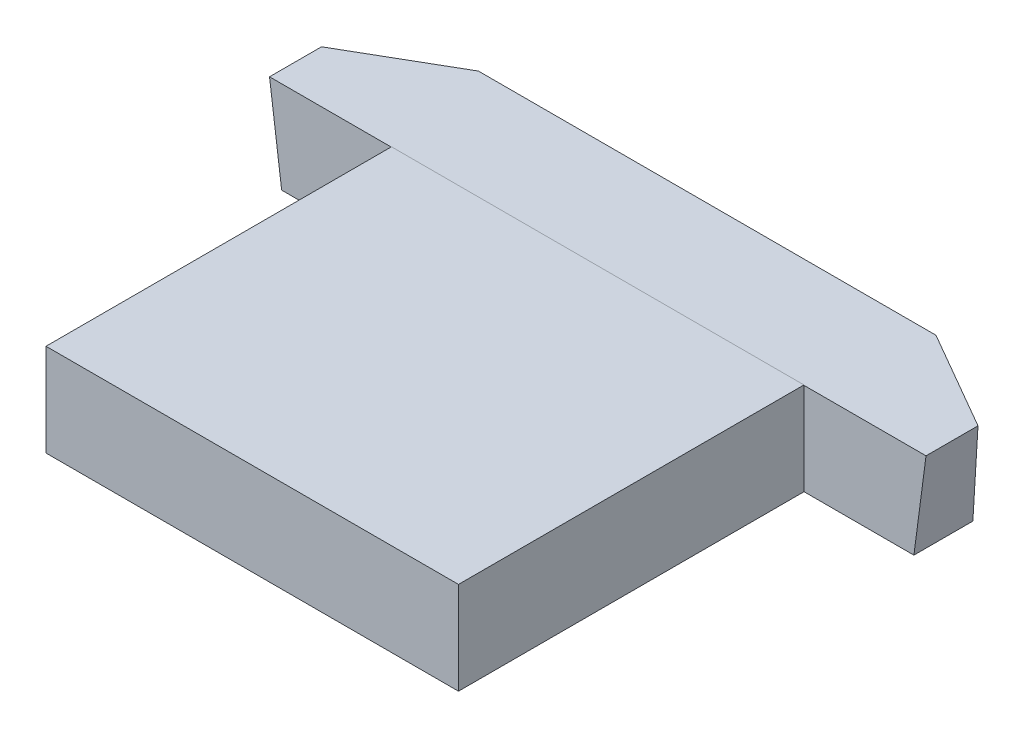
ISO-10303-21;
HEADER;
FILE_DESCRIPTION(('STEP AP214'),'2;1');
FILE_NAME('part.step','',(''),(''),'','','');
FILE_SCHEMA(('AUTOMOTIVE_DESIGN { 1 0 10303 214 1 1 1 1 }'));
ENDSEC;
DATA;
#1=APPLICATION_CONTEXT('core data for automotive mechanical design processes');
#2=APPLICATION_PROTOCOL_DEFINITION('international standard','automotive_design',2000,#1);
#3=PRODUCT_CONTEXT('',#1,'mechanical');
#4=PRODUCT('Part','Part','',(#3));
#5=PRODUCT_RELATED_PRODUCT_CATEGORY('part','',(#4));
#6=PRODUCT_DEFINITION_FORMATION('','',#4);
#7=PRODUCT_DEFINITION_CONTEXT('part definition',#1,'design');
#8=PRODUCT_DEFINITION('design','',#6,#7);
#9=PRODUCT_DEFINITION_SHAPE('','',#8);
#10=(LENGTH_UNIT() NAMED_UNIT(*) SI_UNIT(.MILLI.,.METRE.));
#11=(NAMED_UNIT(*) PLANE_ANGLE_UNIT() SI_UNIT($,.RADIAN.));
#12=(NAMED_UNIT(*) SI_UNIT($,.STERADIAN.) SOLID_ANGLE_UNIT());
#13=UNCERTAINTY_MEASURE_WITH_UNIT(LENGTH_MEASURE(1.E-05),#10,'distance_accuracy_value','');
#14=(GEOMETRIC_REPRESENTATION_CONTEXT(3) GLOBAL_UNCERTAINTY_ASSIGNED_CONTEXT((#13)) GLOBAL_UNIT_ASSIGNED_CONTEXT((#10,
#11,#12)) REPRESENTATION_CONTEXT('',''));
#15=CARTESIAN_POINT('',(0.,0.,0.));
#16=DIRECTION('',(0.,0.,1.));
#17=DIRECTION('',(1.,0.,0.));
#18=AXIS2_PLACEMENT_3D('',#15,#16,#17);
#19=CARTESIAN_POINT('',(3.10999999999989,-2.3789,0.57249999999999));
#20=DIRECTION('',(0.999999999999986,0.,0.));
#21=DIRECTION('',(0.,0.,-0.999999999999986));
#22=AXIS2_PLACEMENT_3D('',#19,#20,#21);
#23=PLANE('',#22);
#24=DIRECTION('',(0.,0.99144486137382,0.130526192219973));
#25=VECTOR('',#24,1.);
#26=CARTESIAN_POINT('',(3.10999999999978,-0.840485049759566,-4.618151955986));
#27=LINE('',#26,#25);
#28=CARTESIAN_POINT('',(3.10999999999967,-0.989999999999561,-4.637835972612));
#29=VERTEX_POINT('',#28);
#30=CARTESIAN_POINT('',(3.10999999999978,-0.983899999999566,-4.63703289237601));
#31=VERTEX_POINT('',#30);
#32=EDGE_CURVE('E11',#29,#31,#27,.T.);
#33=ORIENTED_EDGE('',*,*,#32,.T.);
#34=DIRECTION('',(0.,0.,-0.999999999999986));
#35=VECTOR('',#34,1.);
#36=CARTESIAN_POINT('',(3.10999999999989,-0.983899999999566,-6.2875));
#37=LINE('',#36,#35);
#38=CARTESIAN_POINT('',(3.10999999999989,-0.983900000000003,0.57249999999999));
#39=VERTEX_POINT('',#38);
#40=EDGE_CURVE('E41',#39,#31,#37,.T.);
#41=ORIENTED_EDGE('',*,*,#40,.F.);
#42=DIRECTION('',(0.,1.,0.));
#43=VECTOR('',#42,1.);
#44=CARTESIAN_POINT('',(3.10999999999989,-2.3789,0.57249999999999));
#45=LINE('',#44,#43);
#46=CARTESIAN_POINT('',(3.10999999999989,-2.3789,0.57249999999999));
#47=VERTEX_POINT('',#46);
#48=EDGE_CURVE('E237',#47,#39,#45,.T.);
#49=ORIENTED_EDGE('',*,*,#48,.F.);
#50=DIRECTION('',(0.,0.,-0.999999999999986));
#51=VECTOR('',#50,1.);
#52=CARTESIAN_POINT('',(3.10999999999978,-2.3789,0.408880478543996));
#53=LINE('',#52,#51);
#54=CARTESIAN_POINT('',(3.10999999999967,-2.37889999999957,-4.637835972612));
#55=VERTEX_POINT('',#54);
#56=EDGE_CURVE('E27',#47,#55,#53,.T.);
#57=ORIENTED_EDGE('',*,*,#56,.T.);
#58=DIRECTION('',(0.,1.,0.));
#59=VECTOR('',#58,1.);
#60=CARTESIAN_POINT('',(3.10999999999967,-2.37889999999957,-4.637835972612));
#61=LINE('',#60,#59);
#62=EDGE_CURVE('E173',#55,#29,#61,.T.);
#63=ORIENTED_EDGE('',*,*,#62,.T.);
#64=EDGE_LOOP('',(#33,#41,#49,#57,#63));
#65=FACE_BOUND('',#64,.T.);
#66=ADVANCED_FACE('F16',(#65),#23,.T.);
#67=CARTESIAN_POINT('',(1.77916675358278,-0.983899999999566,-6.56286337769486));
#68=DIRECTION('',(0.,1.,0.));
#69=DIRECTION('',(0.999999999999986,0.,0.));
#70=AXIS2_PLACEMENT_3D('',#67,#68,#69);
#71=PLANE('',#70);
#72=DIRECTION('',(-0.999999999999986,0.,0.));
#73=VECTOR('',#72,1.);
#74=CARTESIAN_POINT('',(-1.650416623208,-0.983899999999566,-4.63703289237687));
#75=LINE('',#74,#73);
#76=CARTESIAN_POINT('',(-3.11,-0.983899999999566,-4.63703289237513));
#77=VERTEX_POINT('',#76);
#78=EDGE_CURVE('E170',#31,#77,#75,.T.);
#79=ORIENTED_EDGE('',*,*,#78,.T.);
#80=DIRECTION('',(0.,0.,0.999999999999986));
#81=VECTOR('',#80,1.);
#82=CARTESIAN_POINT('',(-3.10999999999956,-0.983900000000003,0.572499999999129));
#83=LINE('',#82,#81);
#84=CARTESIAN_POINT('',(-3.10999999999956,-0.983900000000003,0.572499999999129));
#85=VERTEX_POINT('',#84);
#86=EDGE_CURVE('E174',#77,#85,#83,.T.);
#87=ORIENTED_EDGE('',*,*,#86,.T.);
#88=DIRECTION('',(0.999999999999986,0.,0.));
#89=VECTOR('',#88,1.);
#90=CARTESIAN_POINT('',(3.10999999999989,-0.983900000000003,0.57249999999999));
#91=LINE('',#90,#89);
#92=EDGE_CURVE('E88',#85,#39,#91,.T.);
#93=ORIENTED_EDGE('',*,*,#92,.T.);
#94=ORIENTED_EDGE('',*,*,#40,.T.);
#95=EDGE_LOOP('',(#79,#87,#93,#94));
#96=FACE_BOUND('',#95,.T.);
#97=ADVANCED_FACE('F193',(#96),#71,.T.);
#98=CARTESIAN_POINT('',(-3.11,-2.37889999999957,-6.2875));
#99=DIRECTION('',(-0.999999999999986,0.,0.));
#100=DIRECTION('',(0.,1.,0.));
#101=AXIS2_PLACEMENT_3D('',#98,#99,#100);
#102=PLANE('',#101);
#103=DIRECTION('',(0.,-0.99144486137382,-0.130526192219973));
#104=VECTOR('',#103,1.);
#105=CARTESIAN_POINT('',(-3.10999999999999,-1.28435971210956,-4.67658916389913));
#106=LINE('',#105,#104);
#107=CARTESIAN_POINT('',(-3.11,-0.989999999999561,-4.63783597261114));
#108=VERTEX_POINT('',#107);
#109=EDGE_CURVE('E214',#77,#108,#106,.T.);
#110=ORIENTED_EDGE('',*,*,#109,.T.);
#111=DIRECTION('',(0.,-1.,0.));
#112=VECTOR('',#111,1.);
#113=CARTESIAN_POINT('',(-3.11,-2.37889999999957,-4.63783597261114));
#114=LINE('',#113,#112);
#115=CARTESIAN_POINT('',(-3.11,-2.37889999999957,-4.63783597261114));
#116=VERTEX_POINT('',#115);
#117=EDGE_CURVE('E184',#108,#116,#114,.T.);
#118=ORIENTED_EDGE('',*,*,#117,.T.);
#119=DIRECTION('',(0.,0.,0.999999999999986));
#120=VECTOR('',#119,1.);
#121=CARTESIAN_POINT('',(-3.11,-2.3789,-3.02111952145513));
#122=LINE('',#121,#120);
#123=CARTESIAN_POINT('',(-3.10999999999956,-2.3789,0.572499999999129));
#124=VERTEX_POINT('',#123);
#125=EDGE_CURVE('E180',#116,#124,#122,.T.);
#126=ORIENTED_EDGE('',*,*,#125,.T.);
#127=DIRECTION('',(0.,1.,0.));
#128=VECTOR('',#127,1.);
#129=CARTESIAN_POINT('',(-3.10999999999956,-2.3789,0.572499999999129));
#130=LINE('',#129,#128);
#131=EDGE_CURVE('E185',#124,#85,#130,.T.);
#132=ORIENTED_EDGE('',*,*,#131,.T.);
#133=ORIENTED_EDGE('',*,*,#86,.F.);
#134=EDGE_LOOP('',(#110,#118,#126,#132,#133));
#135=FACE_BOUND('',#134,.T.);
#136=ADVANCED_FACE('F198',(#135),#102,.T.);
#137=CARTESIAN_POINT('',(-4.94966402738778,-2.37889999999957,-4.637835972612));
#138=DIRECTION('',(0.,0.,0.999999999999986));
#139=DIRECTION('',(0.999999999999986,0.,0.));
#140=AXIS2_PLACEMENT_3D('',#137,#138,#139);
#141=PLANE('',#140);
#142=DIRECTION('',(-0.999999999999986,0.,0.));
#143=VECTOR('',#142,1.);
#144=CARTESIAN_POINT('',(7.83792434831367,-0.989999999999561,-4.637835972612));
#145=LINE('',#144,#143);
#146=CARTESIAN_POINT('',(-4.94966402738778,-0.989999999999561,-4.63783597261286));
#147=VERTEX_POINT('',#146);
#148=EDGE_CURVE('E102',#108,#147,#145,.T.);
#149=ORIENTED_EDGE('',*,*,#148,.T.);
#150=DIRECTION('',(0.130526192219973,-0.99144486137382,0.));
#151=VECTOR('',#150,1.);
#152=CARTESIAN_POINT('',(-4.92496357075878,-1.17761859503256,-4.637835972612));
#153=LINE('',#152,#151);
#154=CARTESIAN_POINT('',(-4.76681187348921,-2.37889999999957,-4.637835972612));
#155=VERTEX_POINT('',#154);
#156=EDGE_CURVE('E207',#147,#155,#153,.T.);
#157=ORIENTED_EDGE('',*,*,#156,.T.);
#158=DIRECTION('',(0.999999999999986,0.,0.));
#159=VECTOR('',#158,1.);
#160=CARTESIAN_POINT('',(-2.00066084279178,-2.37889999999957,-4.63783597261114));
#161=LINE('',#160,#159);
#162=EDGE_CURVE('E148',#155,#116,#161,.T.);
#163=ORIENTED_EDGE('',*,*,#162,.T.);
#164=ORIENTED_EDGE('',*,*,#117,.F.);
#165=EDGE_LOOP('',(#149,#157,#163,#164));
#166=FACE_BOUND('',#165,.T.);
#167=ADVANCED_FACE('F362',(#166),#141,.T.);
#168=CARTESIAN_POINT('',(-4.94966402738778,-2.37889999999957,-4.637835972612));
#169=DIRECTION('',(0.,0.,0.999999999999986));
#170=DIRECTION('',(0.999999999999986,0.,0.));
#171=AXIS2_PLACEMENT_3D('',#168,#169,#170);
#172=PLANE('',#171);
#173=DIRECTION('',(-0.999999999999986,0.,0.));
#174=VECTOR('',#173,1.);
#175=CARTESIAN_POINT('',(7.83792434831367,-0.989999999999561,-4.637835972612));
#176=LINE('',#175,#174);
#177=CARTESIAN_POINT('',(4.94966402738778,-0.989999999999561,-4.637835972612));
#178=VERTEX_POINT('',#177);
#179=EDGE_CURVE('E222',#178,#29,#176,.T.);
#180=ORIENTED_EDGE('',*,*,#179,.T.);
#181=ORIENTED_EDGE('',*,*,#62,.F.);
#182=DIRECTION('',(0.999999999999986,0.,0.));
#183=VECTOR('',#182,1.);
#184=CARTESIAN_POINT('',(-2.00066084279178,-2.37889999999957,-4.63783597261114));
#185=LINE('',#184,#183);
#186=CARTESIAN_POINT('',(4.76681187348889,-2.37889999999957,-4.63783597261201));
#187=VERTEX_POINT('',#186);
#188=EDGE_CURVE('E226',#55,#187,#185,.T.);
#189=ORIENTED_EDGE('',*,*,#188,.T.);
#190=DIRECTION('',(0.130526192219973,0.99144486137382,0.));
#191=VECTOR('',#190,1.);
#192=CARTESIAN_POINT('',(4.84063571481867,-1.81815225360656,-4.637835972612));
#193=LINE('',#192,#191);
#194=EDGE_CURVE('E232',#187,#178,#193,.T.);
#195=ORIENTED_EDGE('',*,*,#194,.T.);
#196=EDGE_LOOP('',(#180,#181,#189,#195));
#197=FACE_BOUND('',#196,.T.);
#198=ADVANCED_FACE('F280',(#197),#172,.T.);
#199=CARTESIAN_POINT('',(-3.10999999999956,-2.3789,0.572499999999129));
#200=DIRECTION('',(0.,0.,0.999999999999986));
#201=DIRECTION('',(0.999999999999986,0.,0.));
#202=AXIS2_PLACEMENT_3D('',#199,#200,#201);
#203=PLANE('',#202);
#204=DIRECTION('',(0.999999999999986,0.,0.));
#205=VECTOR('',#204,1.);
#206=CARTESIAN_POINT('',(-1.080828829097,-2.3789,0.572500000000004));
#207=LINE('',#206,#205);
#208=EDGE_CURVE('E254',#124,#47,#207,.T.);
#209=ORIENTED_EDGE('',*,*,#208,.T.);
#210=ORIENTED_EDGE('',*,*,#48,.T.);
#211=ORIENTED_EDGE('',*,*,#92,.F.);
#212=ORIENTED_EDGE('',*,*,#131,.F.);
#213=EDGE_LOOP('',(#209,#210,#211,#212));
#214=FACE_BOUND('',#213,.T.);
#215=ADVANCED_FACE('F379',(#214),#203,.T.);
#216=CARTESIAN_POINT('',(5.07999999999978,4.37150315946155E-13,-4.5075));
#217=DIRECTION('',(0.991444861373806,-0.130526192219976,0.));
#218=DIRECTION('',(0.,0.,-0.999999999999986));
#219=AXIS2_PLACEMENT_3D('',#216,#217,#218);
#220=PLANE('',#219);
#221=ORIENTED_EDGE('',*,*,#194,.F.);
#222=DIRECTION('',(0.,0.,-0.999999999999986));
#223=VECTOR('',#222,1.);
#224=CARTESIAN_POINT('',(4.76681187348878,-2.3789,-2.13111952145599));
#225=LINE('',#224,#223);
#226=CARTESIAN_POINT('',(4.76681187348878,-2.37889999999957,-5.52704433649101));
#227=VERTEX_POINT('',#226);
#228=EDGE_CURVE('E233',#187,#227,#225,.T.);
#229=ORIENTED_EDGE('',*,*,#228,.T.);
#230=DIRECTION('',(0.130157132392033,0.988641573667275,0.0751462554235118));
#231=VECTOR('',#230,1.);
#232=CARTESIAN_POINT('',(4.77002848932789,-2.35446737701156,-5.525187222471));
#233=LINE('',#232,#231);
#234=CARTESIAN_POINT('',(4.94966402738789,-0.989999999999561,-5.42147459621599));
#235=VERTEX_POINT('',#234);
#236=EDGE_CURVE('E238',#227,#235,#233,.T.);
#237=ORIENTED_EDGE('',*,*,#236,.T.);
#238=DIRECTION('',(0.,0.,0.999999999999986));
#239=VECTOR('',#238,1.);
#240=CARTESIAN_POINT('',(4.94966402738778,-0.989999999999561,-4.637835972612));
#241=LINE('',#240,#239);
#242=EDGE_CURVE('E168',#235,#178,#241,.T.);
#243=ORIENTED_EDGE('',*,*,#242,.T.);
#244=EDGE_LOOP('',(#221,#229,#237,#243));
#245=FACE_BOUND('',#244,.T.);
#246=ADVANCED_FACE('F285',(#245),#220,.T.);
#247=CARTESIAN_POINT('',(0.948342341804784,-2.3789,0.245260957088864));
#248=DIRECTION('',(0.,1.,0.));
#249=DIRECTION('',(0.999999999999986,0.,0.));
#250=AXIS2_PLACEMENT_3D('',#247,#248,#249);
#251=PLANE('',#250);
#252=ORIENTED_EDGE('',*,*,#188,.F.);
#253=ORIENTED_EDGE('',*,*,#56,.F.);
#254=ORIENTED_EDGE('',*,*,#208,.F.);
#255=ORIENTED_EDGE('',*,*,#125,.F.);
#256=ORIENTED_EDGE('',*,*,#162,.F.);
#257=DIRECTION('',(0.,0.,0.999999999999986));
#258=VECTOR('',#257,1.);
#259=CARTESIAN_POINT('',(-4.766811873489,-2.3789,-2.13111952145513));
#260=LINE('',#259,#258);
#261=CARTESIAN_POINT('',(-4.76681187348878,-2.37889999999957,-5.52704433649187));
#262=VERTEX_POINT('',#261);
#263=EDGE_CURVE('E144',#262,#155,#260,.T.);
#264=ORIENTED_EDGE('',*,*,#263,.F.);
#265=DIRECTION('',(-0.866025403784315,0.,0.500000000000169));
#266=VECTOR('',#265,1.);
#267=CARTESIAN_POINT('',(-3.964795875363,-2.37889999999957,-5.99008848890399));
#268=LINE('',#267,#266);
#269=CARTESIAN_POINT('',(-3.449664027388,-2.37889999999957,-6.28750000000086));
#270=VERTEX_POINT('',#269);
#271=EDGE_CURVE('E20',#270,#262,#268,.T.);
#272=ORIENTED_EDGE('',*,*,#271,.F.);
#273=DIRECTION('',(-0.999999999999986,0.,0.));
#274=VECTOR('',#273,1.);
#275=CARTESIAN_POINT('',(4.39313334505978,-2.37889999999957,-6.2875));
#276=LINE('',#275,#274);
#277=CARTESIAN_POINT('',(3.44966402738778,-2.37889999999957,-6.2875));
#278=VERTEX_POINT('',#277);
#279=EDGE_CURVE('E221',#278,#270,#276,.T.);
#280=ORIENTED_EDGE('',*,*,#279,.F.);
#281=DIRECTION('',(-0.866025403784315,0.,-0.500000000000176));
#282=VECTOR('',#281,1.);
#283=CARTESIAN_POINT('',(4.676052631717,-2.37889999999957,-5.57944420916));
#284=LINE('',#283,#282);
#285=EDGE_CURVE('E188',#227,#278,#284,.T.);
#286=ORIENTED_EDGE('',*,*,#285,.F.);
#287=ORIENTED_EDGE('',*,*,#228,.F.);
#288=EDGE_LOOP('',(#252,#253,#254,#255,#256,#264,#272,#280,#286,#287));
#289=FACE_BOUND('',#288,.T.);
#290=ADVANCED_FACE('F146',(#289),#251,.F.);
#291=CARTESIAN_POINT('',(4.94966402738789,-2.38599999999956,-5.42147459621599));
#292=DIRECTION('',(-0.500000000000176,0.,0.866025403784315));
#293=DIRECTION('',(0.,1.,0.));
#294=AXIS2_PLACEMENT_3D('',#291,#292,#293);
#295=PLANE('',#294);
#296=ORIENTED_EDGE('',*,*,#285,.T.);
#297=DIRECTION('',(0.,1.,0.));
#298=VECTOR('',#297,1.);
#299=CARTESIAN_POINT('',(3.44966402738778,-2.38599999999956,-6.2875));
#300=LINE('',#299,#298);
#301=CARTESIAN_POINT('',(3.44966402738778,-0.989999999999561,-6.2875));
#302=VERTEX_POINT('',#301);
#303=EDGE_CURVE('E164',#278,#302,#300,.T.);
#304=ORIENTED_EDGE('',*,*,#303,.T.);
#305=DIRECTION('',(0.866025403784315,0.,0.500000000000176));
#306=VECTOR('',#305,1.);
#307=CARTESIAN_POINT('',(4.94966402738789,-0.989999999999561,-5.42147459621599));
#308=LINE('',#307,#306);
#309=EDGE_CURVE('E157',#302,#235,#308,.T.);
#310=ORIENTED_EDGE('',*,*,#309,.T.);
#311=ORIENTED_EDGE('',*,*,#236,.F.);
#312=EDGE_LOOP('',(#296,#304,#310,#311));
#313=FACE_BOUND('',#312,.T.);
#314=ADVANCED_FACE('F18',(#313),#295,.F.);
#315=CARTESIAN_POINT('',(-5.07999999999978,4.37150315946155E-13,-4.5075));
#316=DIRECTION('',(-0.991444861373806,-0.130526192219976,0.));
#317=DIRECTION('',(-0.130526192219973,0.99144486137382,0.));
#318=AXIS2_PLACEMENT_3D('',#315,#316,#317);
#319=PLANE('',#318);
#320=ORIENTED_EDGE('',*,*,#156,.F.);
#321=DIRECTION('',(0.,0.,0.999999999999986));
#322=VECTOR('',#321,1.);
#323=CARTESIAN_POINT('',(-4.94966402738778,-0.989999999999561,-4.63783597261286));
#324=LINE('',#323,#322);
#325=CARTESIAN_POINT('',(-4.94966402738778,-0.989999999999561,-5.42147459621599));
#326=VERTEX_POINT('',#325);
#327=EDGE_CURVE('E141',#326,#147,#324,.T.);
#328=ORIENTED_EDGE('',*,*,#327,.F.);
#329=DIRECTION('',(0.130157132392033,-0.988641573667275,-0.0751462554235118));
#330=VECTOR('',#329,1.);
#331=CARTESIAN_POINT('',(-4.770028489328,-2.35446737701157,-5.52518722247013));
#332=LINE('',#331,#330);
#333=EDGE_CURVE('E134',#326,#262,#332,.T.);
#334=ORIENTED_EDGE('',*,*,#333,.T.);
#335=ORIENTED_EDGE('',*,*,#263,.T.);
#336=EDGE_LOOP('',(#320,#328,#334,#335));
#337=FACE_BOUND('',#336,.T.);
#338=ADVANCED_FACE('F155',(#337),#319,.T.);
#339=CARTESIAN_POINT('',(-5.07999999999978,4.37150315946155E-13,-4.5075));
#340=DIRECTION('',(0.,0.130526192219976,-0.991444861373806));
#341=DIRECTION('',(-0.999999999999986,0.,0.));
#342=AXIS2_PLACEMENT_3D('',#339,#340,#341);
#343=PLANE('',#342);
#344=ORIENTED_EDGE('',*,*,#32,.F.);
#345=DIRECTION('',(-0.999999999999986,0.,0.));
#346=VECTOR('',#345,1.);
#347=CARTESIAN_POINT('',(7.83792434831367,-0.989999999999561,-4.637835972612));
#348=LINE('',#347,#346);
#349=EDGE_CURVE('E152',#29,#108,#348,.T.);
#350=ORIENTED_EDGE('',*,*,#349,.T.);
#351=ORIENTED_EDGE('',*,*,#109,.F.);
#352=ORIENTED_EDGE('',*,*,#78,.F.);
#353=EDGE_LOOP('',(#344,#350,#351,#352));
#354=FACE_BOUND('',#353,.T.);
#355=ADVANCED_FACE('F391',(#354),#343,.T.);
#356=CARTESIAN_POINT('',(7.83792434831378,-2.38499999999956,-6.28750000000086));
#357=DIRECTION('',(0.,0.,0.999999999999986));
#358=DIRECTION('',(0.999999999999986,0.,0.));
#359=AXIS2_PLACEMENT_3D('',#356,#357,#358);
#360=PLANE('',#359);
#361=ORIENTED_EDGE('',*,*,#279,.T.);
#362=DIRECTION('',(0.,1.,0.));
#363=VECTOR('',#362,1.);
#364=CARTESIAN_POINT('',(-3.449664027388,-2.38599999999956,-6.28750000000086));
#365=LINE('',#364,#363);
#366=CARTESIAN_POINT('',(-3.449664027388,-0.989999999999561,-6.28750000000088));
#367=VERTEX_POINT('',#366);
#368=EDGE_CURVE('E137',#270,#367,#365,.T.);
#369=ORIENTED_EDGE('',*,*,#368,.T.);
#370=DIRECTION('',(-0.999999999999986,0.,0.));
#371=VECTOR('',#370,1.);
#372=CARTESIAN_POINT('',(7.83792434831378,-0.989999999999561,-6.28750000000086));
#373=LINE('',#372,#371);
#374=EDGE_CURVE('E175',#302,#367,#373,.T.);
#375=ORIENTED_EDGE('',*,*,#374,.F.);
#376=ORIENTED_EDGE('',*,*,#303,.F.);
#377=EDGE_LOOP('',(#361,#369,#375,#376));
#378=FACE_BOUND('',#377,.T.);
#379=ADVANCED_FACE('F399',(#378),#360,.F.);
#380=CARTESIAN_POINT('',(7.83792434831367,-0.989999999999561,-4.637835972612));
#381=DIRECTION('',(0.,-1.,0.));
#382=DIRECTION('',(0.,0.,-0.999999999999986));
#383=AXIS2_PLACEMENT_3D('',#380,#381,#382);
#384=PLANE('',#383);
#385=ORIENTED_EDGE('',*,*,#374,.T.);
#386=DIRECTION('',(0.866025403784315,0.,-0.500000000000169));
#387=VECTOR('',#386,1.);
#388=CARTESIAN_POINT('',(-4.94966402738778,-0.989999999999561,-5.42147459621599));
#389=LINE('',#388,#387);
#390=EDGE_CURVE('E142',#326,#367,#389,.T.);
#391=ORIENTED_EDGE('',*,*,#390,.F.);
#392=ORIENTED_EDGE('',*,*,#327,.T.);
#393=ORIENTED_EDGE('',*,*,#148,.F.);
#394=ORIENTED_EDGE('',*,*,#349,.F.);
#395=ORIENTED_EDGE('',*,*,#179,.F.);
#396=ORIENTED_EDGE('',*,*,#242,.F.);
#397=ORIENTED_EDGE('',*,*,#309,.F.);
#398=EDGE_LOOP('',(#385,#391,#392,#393,#394,#395,#396,#397));
#399=FACE_BOUND('',#398,.T.);
#400=ADVANCED_FACE('F283',(#399),#384,.F.);
#401=CARTESIAN_POINT('',(-4.94966402738778,-2.38599999999956,-5.42147459621599));
#402=DIRECTION('',(0.500000000000169,0.,0.866025403784315));
#403=DIRECTION('',(0.,-1.,0.));
#404=AXIS2_PLACEMENT_3D('',#401,#402,#403);
#405=PLANE('',#404);
#406=ORIENTED_EDGE('',*,*,#271,.T.);
#407=ORIENTED_EDGE('',*,*,#333,.F.);
#408=ORIENTED_EDGE('',*,*,#390,.T.);
#409=ORIENTED_EDGE('',*,*,#368,.F.);
#410=EDGE_LOOP('',(#406,#407,#408,#409));
#411=FACE_BOUND('',#410,.T.);
#412=ADVANCED_FACE('F131',(#411),#405,.F.);
#413=CLOSED_SHELL('',(#66,#97,#136,#167,#198,#215,#246,#290,#314,#338,#355,#379,#400,#412));
#414=MANIFOLD_SOLID_BREP('B1',#413);
#415=ADVANCED_BREP_SHAPE_REPRESENTATION('',(#18,#414),#14);
#416=SHAPE_DEFINITION_REPRESENTATION(#9,#415);
ENDSEC;
END-ISO-10303-21;
